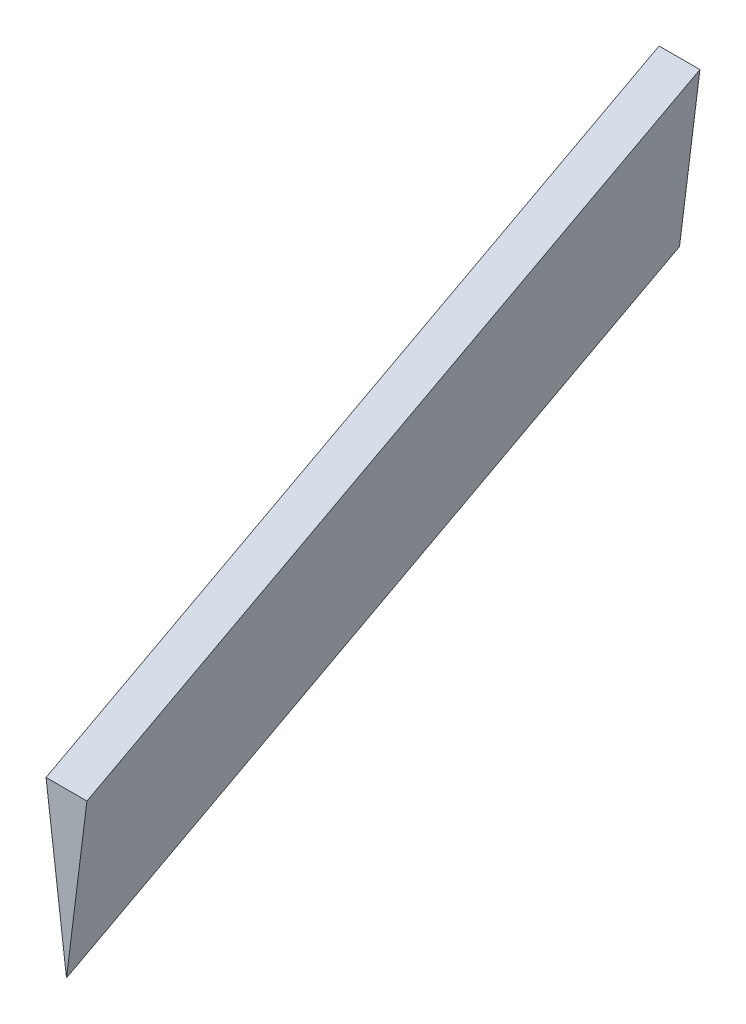
ISO-10303-21;
HEADER;
FILE_DESCRIPTION(('STEP AP214'),'2;1');
FILE_NAME('part.step','',(''),(''),'','','');
FILE_SCHEMA(('AUTOMOTIVE_DESIGN { 1 0 10303 214 1 1 1 1 }'));
ENDSEC;
DATA;
#1=APPLICATION_CONTEXT('core data for automotive mechanical design processes');
#2=APPLICATION_PROTOCOL_DEFINITION('international standard','automotive_design',2000,#1);
#3=PRODUCT_CONTEXT('',#1,'mechanical');
#4=PRODUCT('Part','Part','',(#3));
#5=PRODUCT_RELATED_PRODUCT_CATEGORY('part','',(#4));
#6=PRODUCT_DEFINITION_FORMATION('','',#4);
#7=PRODUCT_DEFINITION_CONTEXT('part definition',#1,'design');
#8=PRODUCT_DEFINITION('design','',#6,#7);
#9=PRODUCT_DEFINITION_SHAPE('','',#8);
#10=(LENGTH_UNIT() NAMED_UNIT(*) SI_UNIT(.MILLI.,.METRE.));
#11=(NAMED_UNIT(*) PLANE_ANGLE_UNIT() SI_UNIT($,.RADIAN.));
#12=(NAMED_UNIT(*) SI_UNIT($,.STERADIAN.) SOLID_ANGLE_UNIT());
#13=UNCERTAINTY_MEASURE_WITH_UNIT(LENGTH_MEASURE(1.E-05),#10,'distance_accuracy_value','');
#14=(GEOMETRIC_REPRESENTATION_CONTEXT(3) GLOBAL_UNCERTAINTY_ASSIGNED_CONTEXT((#13)) GLOBAL_UNIT_ASSIGNED_CONTEXT((#10,
#11,#12)) REPRESENTATION_CONTEXT('',''));
#15=CARTESIAN_POINT('',(0.,0.,0.));
#16=DIRECTION('',(0.,0.,1.));
#17=DIRECTION('',(1.,0.,0.));
#18=AXIS2_PLACEMENT_3D('',#15,#16,#17);
#19=CARTESIAN_POINT('',(0.,0.,0.));
#20=DIRECTION('',(0.,0.,1.));
#21=DIRECTION('',(1.,0.,0.));
#22=AXIS2_PLACEMENT_3D('',#19,#20,#21);
#23=PLANE('',#22);
#24=DIRECTION('',(-1.,0.,0.));
#25=VECTOR('',#24,1.);
#26=CARTESIAN_POINT('',(3.175,0.,0.));
#27=LINE('',#26,#25);
#28=CARTESIAN_POINT('',(3.175,0.,0.));
#29=VERTEX_POINT('',#28);
#30=CARTESIAN_POINT('',(-3.175,0.,0.));
#31=VERTEX_POINT('',#30);
#32=EDGE_CURVE('E74',#29,#31,#27,.T.);
#33=ORIENTED_EDGE('',*,*,#32,.T.);
#34=DIRECTION('',(0.124034734589208,-0.992277876713668,0.));
#35=VECTOR('',#34,1.);
#36=CARTESIAN_POINT('',(-3.175,0.,0.));
#37=LINE('',#36,#35);
#38=CARTESIAN_POINT('',(0.,-25.4,0.));
#39=VERTEX_POINT('',#38);
#40=EDGE_CURVE('E70',#31,#39,#37,.T.);
#41=ORIENTED_EDGE('',*,*,#40,.T.);
#42=DIRECTION('',(0.124034734589208,0.992277876713668,0.));
#43=VECTOR('',#42,1.);
#44=CARTESIAN_POINT('',(0.,-25.4,0.));
#45=LINE('',#44,#43);
#46=EDGE_CURVE('E66',#39,#29,#45,.T.);
#47=ORIENTED_EDGE('',*,*,#46,.T.);
#48=EDGE_LOOP('',(#33,#41,#47));
#49=FACE_BOUND('',#48,.T.);
#50=ADVANCED_FACE('F33',(#49),#23,.T.);
#51=CARTESIAN_POINT('',(0.,50.8,-95.25));
#52=DIRECTION('',(0.,0.,1.));
#53=DIRECTION('',(1.,0.,0.));
#54=AXIS2_PLACEMENT_3D('',#51,#52,#53);
#55=PLANE('',#54);
#56=DIRECTION('',(-1.,0.,0.));
#57=VECTOR('',#56,1.);
#58=CARTESIAN_POINT('',(3.175,50.8,-95.25));
#59=LINE('',#58,#57);
#60=CARTESIAN_POINT('',(3.175,50.8,-95.25));
#61=VERTEX_POINT('',#60);
#62=CARTESIAN_POINT('',(-3.175,50.8,-95.25));
#63=VERTEX_POINT('',#62);
#64=EDGE_CURVE('E56',#61,#63,#59,.T.);
#65=ORIENTED_EDGE('',*,*,#64,.F.);
#66=DIRECTION('',(0.124034734589208,0.992277876713668,0.));
#67=VECTOR('',#66,1.);
#68=CARTESIAN_POINT('',(0.,25.4,-95.25));
#69=LINE('',#68,#67);
#70=CARTESIAN_POINT('',(0.,25.4,-95.25));
#71=VERTEX_POINT('',#70);
#72=EDGE_CURVE('E11',#71,#61,#69,.T.);
#73=ORIENTED_EDGE('',*,*,#72,.F.);
#74=DIRECTION('',(0.124034734589208,-0.992277876713668,0.));
#75=VECTOR('',#74,1.);
#76=CARTESIAN_POINT('',(-3.175,50.8,-95.25));
#77=LINE('',#76,#75);
#78=EDGE_CURVE('E47',#63,#71,#77,.T.);
#79=ORIENTED_EDGE('',*,*,#78,.F.);
#80=EDGE_LOOP('',(#65,#73,#79));
#81=FACE_BOUND('',#80,.T.);
#82=ADVANCED_FACE('F95',(#81),#55,.F.);
#83=CARTESIAN_POINT('',(3.175,0.,0.));
#84=DIRECTION('',(0.,-0.882352941176471,-0.470588235294118));
#85=DIRECTION('',(0.,0.470588235294118,-0.882352941176471));
#86=AXIS2_PLACEMENT_3D('',#83,#84,#85);
#87=PLANE('',#86);
#88=DIRECTION('',(0.,0.470588235294118,-0.882352941176471));
#89=VECTOR('',#88,1.);
#90=CARTESIAN_POINT('',(-3.175,0.,0.));
#91=LINE('',#90,#89);
#92=EDGE_CURVE('E77',#31,#63,#91,.T.);
#93=ORIENTED_EDGE('',*,*,#92,.F.);
#94=ORIENTED_EDGE('',*,*,#32,.F.);
#95=DIRECTION('',(0.,0.470588235294118,-0.882352941176471));
#96=VECTOR('',#95,1.);
#97=CARTESIAN_POINT('',(3.175,0.,0.));
#98=LINE('',#97,#96);
#99=EDGE_CURVE('E76',#29,#61,#98,.T.);
#100=ORIENTED_EDGE('',*,*,#99,.T.);
#101=ORIENTED_EDGE('',*,*,#64,.T.);
#102=EDGE_LOOP('',(#93,#94,#100,#101));
#103=FACE_BOUND('',#102,.T.);
#104=ADVANCED_FACE('F75',(#103),#87,.F.);
#105=CARTESIAN_POINT('',(-3.175,0.,0.));
#106=DIRECTION('',(0.990113838694715,0.123764229836839,0.0660075892463143));
#107=DIRECTION('',(-0.124034734589208,0.992277876713668,0.));
#108=AXIS2_PLACEMENT_3D('',#105,#106,#107);
#109=PLANE('',#108);
#110=DIRECTION('',(0.,0.470588235294118,-0.882352941176471));
#111=VECTOR('',#110,1.);
#112=CARTESIAN_POINT('',(0.,-25.4,0.));
#113=LINE('',#112,#111);
#114=EDGE_CURVE('E40',#39,#71,#113,.T.);
#115=ORIENTED_EDGE('',*,*,#114,.F.);
#116=ORIENTED_EDGE('',*,*,#40,.F.);
#117=ORIENTED_EDGE('',*,*,#92,.T.);
#118=ORIENTED_EDGE('',*,*,#78,.T.);
#119=EDGE_LOOP('',(#115,#116,#117,#118));
#120=FACE_BOUND('',#119,.T.);
#121=ADVANCED_FACE('F87',(#120),#109,.F.);
#122=CARTESIAN_POINT('',(0.,-25.4,0.));
#123=DIRECTION('',(-0.990113838694715,0.123764229836839,0.0660075892463143));
#124=DIRECTION('',(-0.124034734589208,-0.992277876713668,0.));
#125=AXIS2_PLACEMENT_3D('',#122,#123,#124);
#126=PLANE('',#125);
#127=ORIENTED_EDGE('',*,*,#72,.T.);
#128=ORIENTED_EDGE('',*,*,#99,.F.);
#129=ORIENTED_EDGE('',*,*,#46,.F.);
#130=ORIENTED_EDGE('',*,*,#114,.T.);
#131=EDGE_LOOP('',(#127,#128,#129,#130));
#132=FACE_BOUND('',#131,.T.);
#133=ADVANCED_FACE('F80',(#132),#126,.F.);
#134=CLOSED_SHELL('',(#50,#82,#104,#121,#133));
#135=MANIFOLD_SOLID_BREP('B2',#134);
#136=ADVANCED_BREP_SHAPE_REPRESENTATION('',(#18,#135),#14);
#137=SHAPE_DEFINITION_REPRESENTATION(#9,#136);
ENDSEC;
END-ISO-10303-21;
